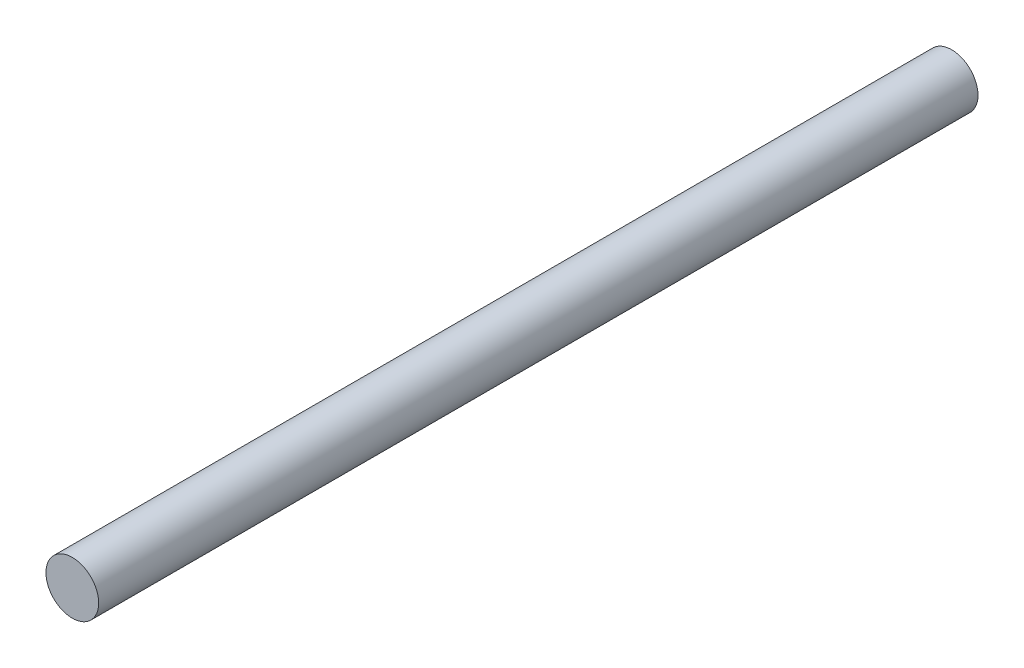
ISO-10303-21;
HEADER;
FILE_DESCRIPTION(('STEP AP214'),'2;1');
FILE_NAME('part.step','',(''),(''),'','','');
FILE_SCHEMA(('AUTOMOTIVE_DESIGN { 1 0 10303 214 1 1 1 1 }'));
ENDSEC;
DATA;
#1=APPLICATION_CONTEXT('core data for automotive mechanical design processes');
#2=APPLICATION_PROTOCOL_DEFINITION('international standard','automotive_design',2000,#1);
#3=PRODUCT_CONTEXT('',#1,'mechanical');
#4=PRODUCT('Part','Part','',(#3));
#5=PRODUCT_RELATED_PRODUCT_CATEGORY('part','',(#4));
#6=PRODUCT_DEFINITION_FORMATION('','',#4);
#7=PRODUCT_DEFINITION_CONTEXT('part definition',#1,'design');
#8=PRODUCT_DEFINITION('design','',#6,#7);
#9=PRODUCT_DEFINITION_SHAPE('','',#8);
#10=(LENGTH_UNIT() NAMED_UNIT(*) SI_UNIT(.MILLI.,.METRE.));
#11=(NAMED_UNIT(*) PLANE_ANGLE_UNIT() SI_UNIT($,.RADIAN.));
#12=(NAMED_UNIT(*) SI_UNIT($,.STERADIAN.) SOLID_ANGLE_UNIT());
#13=UNCERTAINTY_MEASURE_WITH_UNIT(LENGTH_MEASURE(1.E-05),#10,'distance_accuracy_value','');
#14=(GEOMETRIC_REPRESENTATION_CONTEXT(3) GLOBAL_UNCERTAINTY_ASSIGNED_CONTEXT((#13)) GLOBAL_UNIT_ASSIGNED_CONTEXT((#10,
#11,#12)) REPRESENTATION_CONTEXT('',''));
#15=CARTESIAN_POINT('',(0.,0.,0.));
#16=DIRECTION('',(0.,0.,1.));
#17=DIRECTION('',(1.,0.,0.));
#18=AXIS2_PLACEMENT_3D('',#15,#16,#17);
#19=CARTESIAN_POINT('',(0.,0.,100.));
#20=DIRECTION('',(0.,0.,-1.));
#21=DIRECTION('',(-1.,0.,0.));
#22=AXIS2_PLACEMENT_3D('',#19,#20,#21);
#23=CYLINDRICAL_SURFACE('',#22,2.998);
#24=CARTESIAN_POINT('',(0.,0.,100.));
#25=DIRECTION('',(0.,0.,1.));
#26=DIRECTION('',(1.,0.,0.));
#27=AXIS2_PLACEMENT_3D('',#24,#25,#26);
#28=CIRCLE('',#27,2.998);
#29=CARTESIAN_POINT('',(2.998,0.,100.));
#30=VERTEX_POINT('',#29);
#31=EDGE_CURVE('E10',#30,#30,#28,.T.);
#32=ORIENTED_EDGE('',*,*,#31,.F.);
#33=EDGE_LOOP('',(#32));
#34=FACE_BOUND('',#33,.T.);
#35=CARTESIAN_POINT('',(0.,0.,0.));
#36=DIRECTION('',(0.,0.,1.));
#37=DIRECTION('',(1.,0.,0.));
#38=AXIS2_PLACEMENT_3D('',#35,#36,#37);
#39=CIRCLE('',#38,2.998);
#40=CARTESIAN_POINT('',(2.998,0.,0.));
#41=VERTEX_POINT('',#40);
#42=EDGE_CURVE('E35',#41,#41,#39,.T.);
#43=ORIENTED_EDGE('',*,*,#42,.T.);
#44=EDGE_LOOP('',(#43));
#45=FACE_BOUND('',#44,.T.);
#46=ADVANCED_FACE('F32',(#34,#45),#23,.T.);
#47=CARTESIAN_POINT('',(0.,0.,100.));
#48=DIRECTION('',(0.,0.,1.));
#49=DIRECTION('',(1.,0.,0.));
#50=AXIS2_PLACEMENT_3D('',#47,#48,#49);
#51=PLANE('',#50);
#52=ORIENTED_EDGE('',*,*,#31,.T.);
#53=EDGE_LOOP('',(#52));
#54=FACE_BOUND('',#53,.T.);
#55=ADVANCED_FACE('F47',(#54),#51,.T.);
#56=CARTESIAN_POINT('',(0.,0.,0.));
#57=DIRECTION('',(0.,0.,1.));
#58=DIRECTION('',(1.,0.,0.));
#59=AXIS2_PLACEMENT_3D('',#56,#57,#58);
#60=PLANE('',#59);
#61=ORIENTED_EDGE('',*,*,#42,.F.);
#62=EDGE_LOOP('',(#61));
#63=FACE_BOUND('',#62,.T.);
#64=ADVANCED_FACE('F45',(#63),#60,.F.);
#65=CLOSED_SHELL('',(#46,#55,#64));
#66=MANIFOLD_SOLID_BREP('B2',#65);
#67=ADVANCED_BREP_SHAPE_REPRESENTATION('',(#18,#66),#14);
#68=SHAPE_DEFINITION_REPRESENTATION(#9,#67);
ENDSEC;
END-ISO-10303-21;
